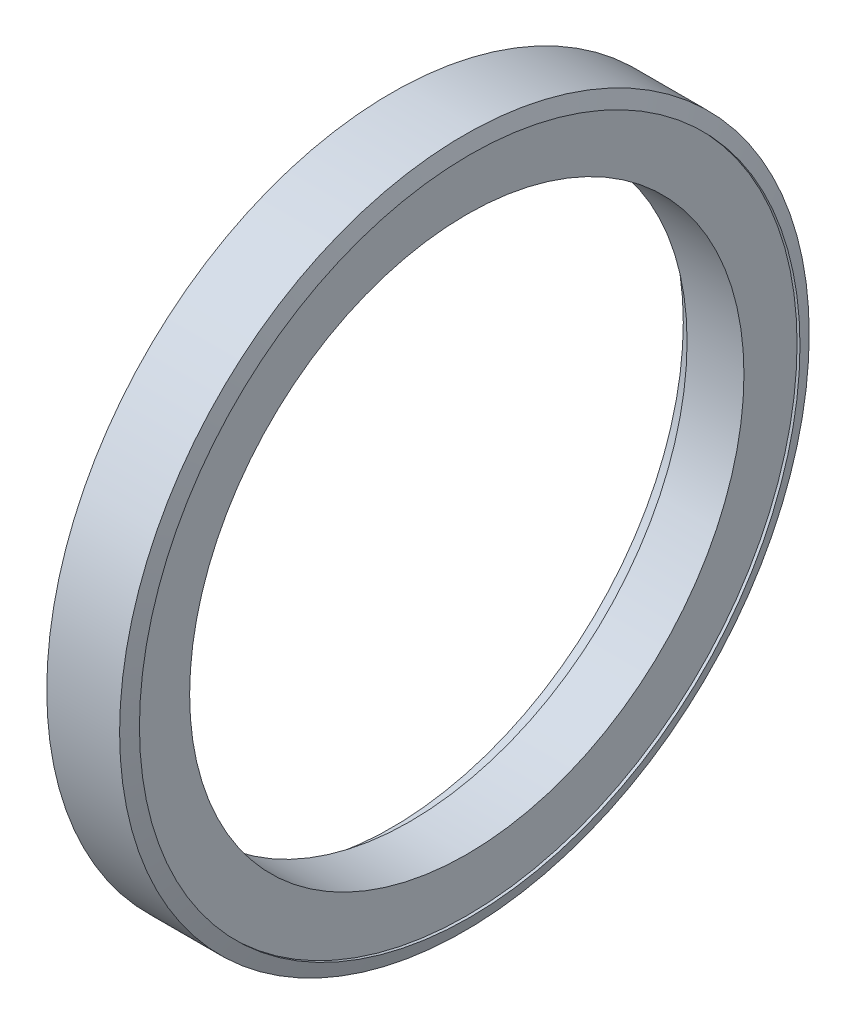
ISO-10303-21;
HEADER;
FILE_DESCRIPTION(('STEP AP214'),'2;1');
FILE_NAME('part.step','',(''),(''),'','','');
FILE_SCHEMA(('AUTOMOTIVE_DESIGN { 1 0 10303 214 1 1 1 1 }'));
ENDSEC;
DATA;
#1=APPLICATION_CONTEXT('core data for automotive mechanical design processes');
#2=APPLICATION_PROTOCOL_DEFINITION('international standard','automotive_design',2000,#1);
#3=PRODUCT_CONTEXT('',#1,'mechanical');
#4=PRODUCT('Part','Part','',(#3));
#5=PRODUCT_RELATED_PRODUCT_CATEGORY('part','',(#4));
#6=PRODUCT_DEFINITION_FORMATION('','',#4);
#7=PRODUCT_DEFINITION_CONTEXT('part definition',#1,'design');
#8=PRODUCT_DEFINITION('design','',#6,#7);
#9=PRODUCT_DEFINITION_SHAPE('','',#8);
#10=(LENGTH_UNIT() NAMED_UNIT(*) SI_UNIT(.MILLI.,.METRE.));
#11=(NAMED_UNIT(*) PLANE_ANGLE_UNIT() SI_UNIT($,.RADIAN.));
#12=(NAMED_UNIT(*) SI_UNIT($,.STERADIAN.) SOLID_ANGLE_UNIT());
#13=UNCERTAINTY_MEASURE_WITH_UNIT(LENGTH_MEASURE(1.E-05),#10,'distance_accuracy_value','');
#14=(GEOMETRIC_REPRESENTATION_CONTEXT(3) GLOBAL_UNCERTAINTY_ASSIGNED_CONTEXT((#13)) GLOBAL_UNIT_ASSIGNED_CONTEXT((#10,
#11,#12)) REPRESENTATION_CONTEXT('',''));
#15=CARTESIAN_POINT('',(0.,0.,0.));
#16=DIRECTION('',(0.,0.,1.));
#17=DIRECTION('',(1.,0.,0.));
#18=AXIS2_PLACEMENT_3D('',#15,#16,#17);
#19=CARTESIAN_POINT('',(8.16530000000087,0.,0.));
#20=DIRECTION('',(1.,0.,0.));
#21=DIRECTION('',(0.,0.,-1.));
#22=AXIS2_PLACEMENT_3D('',#19,#20,#21);
#23=CYLINDRICAL_SURFACE('',#22,48.3870000000008);
#24=CARTESIAN_POINT('',(13.1302000000009,0.,0.));
#25=DIRECTION('',(1.,0.,0.));
#26=DIRECTION('',(0.,0.,-1.));
#27=AXIS2_PLACEMENT_3D('',#24,#25,#26);
#28=CIRCLE('',#27,48.3870000000008);
#29=CARTESIAN_POINT('',(13.1302000000009,0.,-48.3870000000008));
#30=VERTEX_POINT('',#29);
#31=EDGE_CURVE('E17',#30,#30,#28,.F.);
#32=ORIENTED_EDGE('',*,*,#31,.F.);
#33=EDGE_LOOP('',(#32));
#34=FACE_BOUND('',#33,.T.);
#35=CARTESIAN_POINT('',(3.20040000000084,0.,0.));
#36=DIRECTION('',(1.,0.,0.));
#37=DIRECTION('',(0.,0.,-1.));
#38=AXIS2_PLACEMENT_3D('',#35,#36,#37);
#39=CIRCLE('',#38,48.3870000000008);
#40=CARTESIAN_POINT('',(3.20040000000084,0.,-48.3870000000008));
#41=VERTEX_POINT('',#40);
#42=EDGE_CURVE('E40',#41,#41,#39,.T.);
#43=ORIENTED_EDGE('',*,*,#42,.F.);
#44=EDGE_LOOP('',(#43));
#45=FACE_BOUND('',#44,.T.);
#46=ADVANCED_FACE('F14',(#34,#45),#23,.F.);
#47=CARTESIAN_POINT('',(13.1302000000009,53.0225000000004,0.));
#48=DIRECTION('',(1.,0.,0.));
#49=DIRECTION('',(0.,0.,-1.));
#50=AXIS2_PLACEMENT_3D('',#47,#48,#49);
#51=PLANE('',#50);
#52=ORIENTED_EDGE('',*,*,#31,.T.);
#53=EDGE_LOOP('',(#52));
#54=FACE_BOUND('',#53,.T.);
#55=CARTESIAN_POINT('',(13.1302000000009,0.,0.));
#56=DIRECTION('',(1.,0.,0.));
#57=DIRECTION('',(0.,0.,-1.));
#58=AXIS2_PLACEMENT_3D('',#55,#56,#57);
#59=CIRCLE('',#58,57.6580000000002);
#60=CARTESIAN_POINT('',(13.1302000000009,0.,-57.6580000000002));
#61=VERTEX_POINT('',#60);
#62=EDGE_CURVE('E38',#61,#61,#59,.T.);
#63=ORIENTED_EDGE('',*,*,#62,.T.);
#64=EDGE_LOOP('',(#63));
#65=FACE_BOUND('',#64,.T.);
#66=ADVANCED_FACE('F47',(#54,#65),#51,.T.);
#67=CARTESIAN_POINT('',(3.20040000000084,49.6570000000003,0.));
#68=DIRECTION('',(-1.,0.,0.));
#69=DIRECTION('',(0.,0.,1.));
#70=AXIS2_PLACEMENT_3D('',#67,#68,#69);
#71=PLANE('',#70);
#72=ORIENTED_EDGE('',*,*,#42,.T.);
#73=EDGE_LOOP('',(#72));
#74=FACE_BOUND('',#73,.T.);
#75=CARTESIAN_POINT('',(3.20040000000084,0.,0.));
#76=DIRECTION('',(1.,0.,0.));
#77=DIRECTION('',(0.,0.,-1.));
#78=AXIS2_PLACEMENT_3D('',#75,#76,#77);
#79=CIRCLE('',#78,50.9269999999999);
#80=CARTESIAN_POINT('',(3.20040000000084,0.,-50.9269999999999));
#81=VERTEX_POINT('',#80);
#82=EDGE_CURVE('E35',#81,#81,#79,.F.);
#83=ORIENTED_EDGE('',*,*,#82,.T.);
#84=EDGE_LOOP('',(#83));
#85=FACE_BOUND('',#84,.T.);
#86=ADVANCED_FACE('F56',(#74,#85),#71,.T.);
#87=CARTESIAN_POINT('',(13.3852000000009,0.,0.));
#88=DIRECTION('',(1.,0.,0.));
#89=DIRECTION('',(0.,0.,-1.));
#90=AXIS2_PLACEMENT_3D('',#87,#88,#89);
#91=CYLINDRICAL_SURFACE('',#90,57.6580000000002);
#92=CARTESIAN_POINT('',(13.640200001774,0.,0.));
#93=DIRECTION('',(-1.,0.,0.));
#94=DIRECTION('',(0.,1.,0.));
#95=AXIS2_PLACEMENT_3D('',#92,#93,#94);
#96=CIRCLE('',#95,57.6580000006455);
#97=CARTESIAN_POINT('',(13.640200001774,57.6580000006454,0.));
#98=VERTEX_POINT('',#97);
#99=EDGE_CURVE('E34',#98,#98,#96,.T.);
#100=ORIENTED_EDGE('',*,*,#99,.F.);
#101=EDGE_LOOP('',(#100));
#102=FACE_BOUND('',#101,.T.);
#103=ORIENTED_EDGE('',*,*,#62,.F.);
#104=EDGE_LOOP('',(#103));
#105=FACE_BOUND('',#104,.T.);
#106=ADVANCED_FACE('F75',(#102,#105),#91,.F.);
#107=CARTESIAN_POINT('',(1.60020000000043,0.,0.));
#108=DIRECTION('',(1.,0.,0.));
#109=DIRECTION('',(0.,0.,-1.));
#110=AXIS2_PLACEMENT_3D('',#107,#108,#109);
#111=CYLINDRICAL_SURFACE('',#110,50.9269999999999);
#112=ORIENTED_EDGE('',*,*,#82,.F.);
#113=EDGE_LOOP('',(#112));
#114=FACE_BOUND('',#113,.T.);
#115=CARTESIAN_POINT('',(0.,0.,0.));
#116=DIRECTION('',(1.,0.,0.));
#117=DIRECTION('',(0.,0.,-1.));
#118=AXIS2_PLACEMENT_3D('',#115,#116,#117);
#119=CIRCLE('',#118,50.9269999999999);
#120=CARTESIAN_POINT('',(0.,0.,-50.9269999999999));
#121=VERTEX_POINT('',#120);
#122=EDGE_CURVE('E26',#121,#121,#119,.T.);
#123=ORIENTED_EDGE('',*,*,#122,.F.);
#124=EDGE_LOOP('',(#123));
#125=FACE_BOUND('',#124,.T.);
#126=ADVANCED_FACE('F71',(#114,#125),#111,.F.);
#127=CARTESIAN_POINT('',(12.7157156031903,0.,0.));
#128=DIRECTION('',(-1.,0.,0.));
#129=DIRECTION('',(0.,0.,1.));
#130=AXIS2_PLACEMENT_3D('',#127,#128,#129);
#131=CONICAL_SURFACE('',#130,60.1979999993548,1.22173047499944);
#132=CARTESIAN_POINT('',(12.7157156049633,0.,0.));
#133=DIRECTION('',(1.,0.,0.));
#134=DIRECTION('',(0.,0.,-1.));
#135=AXIS2_PLACEMENT_3D('',#132,#133,#134);
#136=CIRCLE('',#135,60.1980000000001);
#137=CARTESIAN_POINT('',(12.7157156049633,0.,-60.1980000000001));
#138=VERTEX_POINT('',#137);
#139=EDGE_CURVE('E21',#138,#138,#136,.F.);
#140=ORIENTED_EDGE('',*,*,#139,.F.);
#141=EDGE_LOOP('',(#140));
#142=FACE_BOUND('',#141,.T.);
#143=ORIENTED_EDGE('',*,*,#99,.T.);
#144=EDGE_LOOP('',(#143));
#145=FACE_BOUND('',#144,.T.);
#146=ADVANCED_FACE('F64',(#142,#145),#131,.T.);
#147=CARTESIAN_POINT('',(0.,55.5625,0.));
#148=DIRECTION('',(-1.,0.,0.));
#149=DIRECTION('',(0.,0.,1.));
#150=AXIS2_PLACEMENT_3D('',#147,#148,#149);
#151=PLANE('',#150);
#152=ORIENTED_EDGE('',*,*,#122,.T.);
#153=EDGE_LOOP('',(#152));
#154=FACE_BOUND('',#153,.T.);
#155=CARTESIAN_POINT('',(0.,0.,0.));
#156=DIRECTION('',(1.,0.,0.));
#157=DIRECTION('',(0.,0.,-1.));
#158=AXIS2_PLACEMENT_3D('',#155,#156,#157);
#159=CIRCLE('',#158,60.1980000000001);
#160=CARTESIAN_POINT('',(0.,0.,-60.1980000000001));
#161=VERTEX_POINT('',#160);
#162=EDGE_CURVE('E10',#161,#161,#159,.T.);
#163=ORIENTED_EDGE('',*,*,#162,.F.);
#164=EDGE_LOOP('',(#163));
#165=FACE_BOUND('',#164,.T.);
#166=ADVANCED_FACE('F59',(#154,#165),#151,.T.);
#167=CARTESIAN_POINT('',(6.35785780248165,0.,0.));
#168=DIRECTION('',(1.,0.,0.));
#169=DIRECTION('',(0.,0.,-1.));
#170=AXIS2_PLACEMENT_3D('',#167,#168,#169);
#171=CYLINDRICAL_SURFACE('',#170,60.1980000000001);
#172=ORIENTED_EDGE('',*,*,#162,.T.);
#173=EDGE_LOOP('',(#172));
#174=FACE_BOUND('',#173,.T.);
#175=ORIENTED_EDGE('',*,*,#139,.T.);
#176=EDGE_LOOP('',(#175));
#177=FACE_BOUND('',#176,.T.);
#178=ADVANCED_FACE('F57',(#174,#177),#171,.T.);
#179=CLOSED_SHELL('',(#46,#66,#86,#106,#126,#146,#166,#178));
#180=MANIFOLD_SOLID_BREP('B1',#179);
#181=ADVANCED_BREP_SHAPE_REPRESENTATION('',(#18,#180),#14);
#182=SHAPE_DEFINITION_REPRESENTATION(#9,#181);
ENDSEC;
END-ISO-10303-21;
